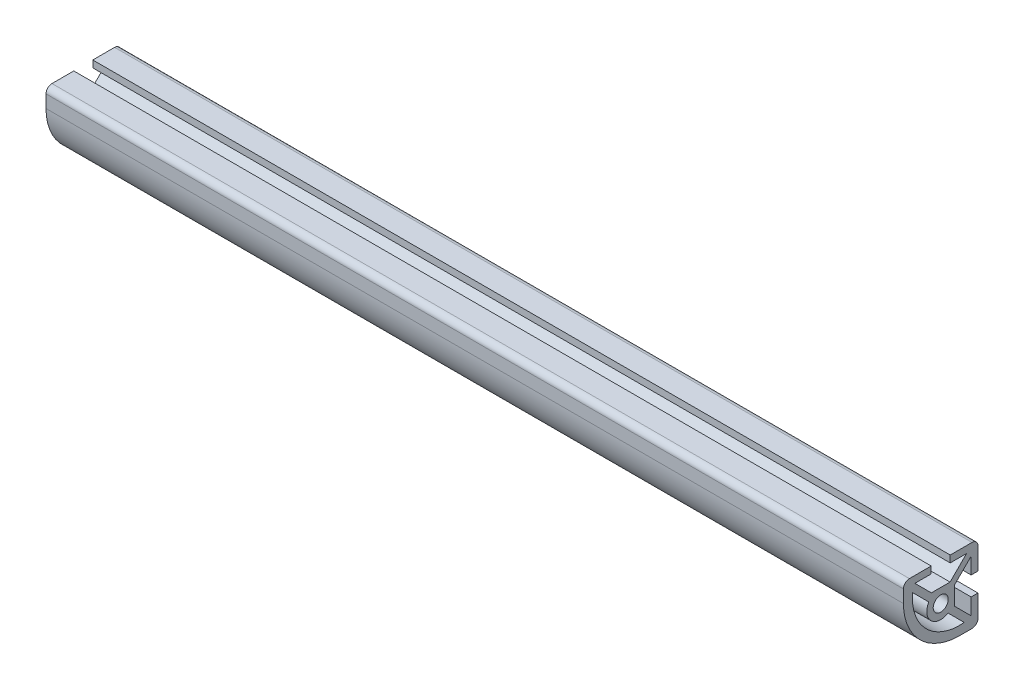
ISO-10303-21;
HEADER;
FILE_DESCRIPTION(('STEP AP214'),'2;1');
FILE_NAME('part.step','',(''),(''),'','','');
FILE_SCHEMA(('AUTOMOTIVE_DESIGN { 1 0 10303 214 1 1 1 1 }'));
ENDSEC;
DATA;
#1=APPLICATION_CONTEXT('core data for automotive mechanical design processes');
#2=APPLICATION_PROTOCOL_DEFINITION('international standard','automotive_design',2000,#1);
#3=PRODUCT_CONTEXT('',#1,'mechanical');
#4=PRODUCT('Part','Part','',(#3));
#5=PRODUCT_RELATED_PRODUCT_CATEGORY('part','',(#4));
#6=PRODUCT_DEFINITION_FORMATION('','',#4);
#7=PRODUCT_DEFINITION_CONTEXT('part definition',#1,'design');
#8=PRODUCT_DEFINITION('design','',#6,#7);
#9=PRODUCT_DEFINITION_SHAPE('','',#8);
#10=(LENGTH_UNIT() NAMED_UNIT(*) SI_UNIT(.MILLI.,.METRE.));
#11=(NAMED_UNIT(*) PLANE_ANGLE_UNIT() SI_UNIT($,.RADIAN.));
#12=(NAMED_UNIT(*) SI_UNIT($,.STERADIAN.) SOLID_ANGLE_UNIT());
#13=UNCERTAINTY_MEASURE_WITH_UNIT(LENGTH_MEASURE(1.E-05),#10,'distance_accuracy_value','');
#14=(GEOMETRIC_REPRESENTATION_CONTEXT(3) GLOBAL_UNCERTAINTY_ASSIGNED_CONTEXT((#13)) GLOBAL_UNIT_ASSIGNED_CONTEXT((#10,
#11,#12)) REPRESENTATION_CONTEXT('',''));
#15=CARTESIAN_POINT('',(0.,0.,0.));
#16=DIRECTION('',(0.,0.,1.));
#17=DIRECTION('',(1.,0.,0.));
#18=AXIS2_PLACEMENT_3D('',#15,#16,#17);
#19=CARTESIAN_POINT('',(146.05,10.668,10.6679999999999));
#20=DIRECTION('',(-1.,0.,0.));
#21=DIRECTION('',(0.,0.,1.));
#22=AXIS2_PLACEMENT_3D('',#19,#20,#21);
#23=PLANE('',#22);
#24=CARTESIAN_POINT('',(146.05,10.668,10.6679999999999));
#25=DIRECTION('',(1.,0.,0.));
#26=DIRECTION('',(0.,0.,1.));
#27=AXIS2_PLACEMENT_3D('',#24,#25,#26);
#28=CIRCLE('',#27,2.03200000000002);
#29=CARTESIAN_POINT('',(146.05,12.7,10.6679999999999));
#30=VERTEX_POINT('',#29);
#31=CARTESIAN_POINT('',(146.05,10.668,12.6999999999999));
#32=VERTEX_POINT('',#31);
#33=EDGE_CURVE('E229',#30,#32,#28,.T.);
#34=ORIENTED_EDGE('',*,*,#33,.T.);
#35=DIRECTION('',(0.,-1.,0.));
#36=VECTOR('',#35,1.);
#37=CARTESIAN_POINT('',(146.05,10.668,12.6999999999999));
#38=LINE('',#37,#36);
#39=CARTESIAN_POINT('',(146.05,6.35000000000034,12.6999999999999));
#40=VERTEX_POINT('',#39);
#41=EDGE_CURVE('E338',#32,#40,#38,.T.);
#42=ORIENTED_EDGE('',*,*,#41,.T.);
#43=CARTESIAN_POINT('',(146.05,6.35,-6.35000000000011));
#44=DIRECTION('',(1.,0.,0.));
#45=DIRECTION('',(0.,0.,-1.));
#46=AXIS2_PLACEMENT_3D('',#43,#44,#45);
#47=CIRCLE('',#46,19.05);
#48=CARTESIAN_POINT('',(146.05,-12.7,-6.35000000000012));
#49=VERTEX_POINT('',#48);
#50=EDGE_CURVE('E340',#40,#49,#47,.T.);
#51=ORIENTED_EDGE('',*,*,#50,.T.);
#52=DIRECTION('',(0.,0.,-1.));
#53=VECTOR('',#52,1.);
#54=CARTESIAN_POINT('',(146.05,-12.7,-10.6679999999999));
#55=LINE('',#54,#53);
#56=CARTESIAN_POINT('',(146.05,-12.7,-10.6679999999999));
#57=VERTEX_POINT('',#56);
#58=EDGE_CURVE('E342',#49,#57,#55,.T.);
#59=ORIENTED_EDGE('',*,*,#58,.T.);
#60=CARTESIAN_POINT('',(146.05,-10.668,-10.6679999999999));
#61=DIRECTION('',(1.,0.,0.));
#62=DIRECTION('',(0.,0.,1.));
#63=AXIS2_PLACEMENT_3D('',#60,#61,#62);
#64=CIRCLE('',#63,2.03200000000001);
#65=CARTESIAN_POINT('',(146.05,-10.668,-12.6999999999999));
#66=VERTEX_POINT('',#65);
#67=EDGE_CURVE('E344',#57,#66,#64,.T.);
#68=ORIENTED_EDGE('',*,*,#67,.T.);
#69=DIRECTION('',(0.,1.,0.));
#70=VECTOR('',#69,1.);
#71=CARTESIAN_POINT('',(146.05,-3.23850000000069,-12.6999999999999));
#72=LINE('',#71,#70);
#73=CARTESIAN_POINT('',(146.05,-3.23850000000069,-12.6999999999999));
#74=VERTEX_POINT('',#73);
#75=EDGE_CURVE('E346',#66,#74,#72,.T.);
#76=ORIENTED_EDGE('',*,*,#75,.T.);
#77=DIRECTION('',(0.,0.,1.));
#78=VECTOR('',#77,1.);
#79=CARTESIAN_POINT('',(146.05,-3.23850000000054,-10.3632000000016));
#80=LINE('',#79,#78);
#81=CARTESIAN_POINT('',(146.05,-3.23850000000054,-10.3632000000016));
#82=VERTEX_POINT('',#81);
#83=EDGE_CURVE('E348',#74,#82,#80,.T.);
#84=ORIENTED_EDGE('',*,*,#83,.T.);
#85=DIRECTION('',(0.,-1.,0.));
#86=VECTOR('',#85,1.);
#87=CARTESIAN_POINT('',(146.05,-8.80063543493584,-10.3632000000016));
#88=LINE('',#87,#86);
#89=CARTESIAN_POINT('',(146.05,-8.80063543493584,-10.3632000000016));
#90=VERTEX_POINT('',#89);
#91=EDGE_CURVE('E350',#82,#90,#88,.T.);
#92=ORIENTED_EDGE('',*,*,#91,.T.);
#93=DIRECTION('',(0.,0.707106781186543,0.707106781186552));
#94=VECTOR('',#93,1.);
#95=CARTESIAN_POINT('',(146.05,-3.18723566949115,-4.74980023455686));
#96=LINE('',#95,#94);
#97=CARTESIAN_POINT('',(146.05,-3.18723566949115,-4.74980023455686));
#98=VERTEX_POINT('',#97);
#99=EDGE_CURVE('E352',#90,#98,#96,.T.);
#100=ORIENTED_EDGE('',*,*,#99,.T.);
#101=DIRECTION('',(0.,1.,0.));
#102=VECTOR('',#101,1.);
#103=CARTESIAN_POINT('',(146.05,3.18723566949115,-4.74980023455665));
#104=LINE('',#103,#102);
#105=CARTESIAN_POINT('',(146.05,3.18723566949115,-4.74980023455665));
#106=VERTEX_POINT('',#105);
#107=EDGE_CURVE('E354',#98,#106,#104,.T.);
#108=ORIENTED_EDGE('',*,*,#107,.T.);
#109=DIRECTION('',(0.,0.707106781186543,-0.707106781186552));
#110=VECTOR('',#109,1.);
#111=CARTESIAN_POINT('',(146.05,8.80063543493585,-10.3632000000014));
#112=LINE('',#111,#110);
#113=CARTESIAN_POINT('',(146.05,8.80063543493585,-10.3632000000014));
#114=VERTEX_POINT('',#113);
#115=EDGE_CURVE('E356',#106,#114,#112,.T.);
#116=ORIENTED_EDGE('',*,*,#115,.T.);
#117=DIRECTION('',(0.,-1.,0.));
#118=VECTOR('',#117,1.);
#119=CARTESIAN_POINT('',(146.05,3.23850000000055,-10.3632000000014));
#120=LINE('',#119,#118);
#121=CARTESIAN_POINT('',(146.05,3.23850000000055,-10.3632000000014));
#122=VERTEX_POINT('',#121);
#123=EDGE_CURVE('E358',#114,#122,#120,.T.);
#124=ORIENTED_EDGE('',*,*,#123,.T.);
#125=DIRECTION('',(0.,0.,-1.));
#126=VECTOR('',#125,1.);
#127=CARTESIAN_POINT('',(146.05,3.23850000000069,-12.7));
#128=LINE('',#127,#126);
#129=CARTESIAN_POINT('',(146.05,3.23850000000069,-12.7));
#130=VERTEX_POINT('',#129);
#131=EDGE_CURVE('E360',#122,#130,#128,.T.);
#132=ORIENTED_EDGE('',*,*,#131,.T.);
#133=DIRECTION('',(0.,1.,0.));
#134=VECTOR('',#133,1.);
#135=CARTESIAN_POINT('',(146.05,10.668,-12.7));
#136=LINE('',#135,#134);
#137=CARTESIAN_POINT('',(146.05,10.668,-12.7));
#138=VERTEX_POINT('',#137);
#139=EDGE_CURVE('E362',#130,#138,#136,.T.);
#140=ORIENTED_EDGE('',*,*,#139,.T.);
#141=CARTESIAN_POINT('',(146.05,10.668,-10.668));
#142=DIRECTION('',(1.,0.,0.));
#143=DIRECTION('',(0.,0.,1.));
#144=AXIS2_PLACEMENT_3D('',#141,#142,#143);
#145=CIRCLE('',#144,2.03200000000001);
#146=CARTESIAN_POINT('',(146.05,12.7,-10.668));
#147=VERTEX_POINT('',#146);
#148=EDGE_CURVE('E364',#138,#147,#145,.T.);
#149=ORIENTED_EDGE('',*,*,#148,.T.);
#150=DIRECTION('',(0.,0.,1.));
#151=VECTOR('',#150,1.);
#152=CARTESIAN_POINT('',(146.05,12.7,-3.23850000000062));
#153=LINE('',#152,#151);
#154=CARTESIAN_POINT('',(146.05,12.7,-3.23850000000062));
#155=VERTEX_POINT('',#154);
#156=EDGE_CURVE('E366',#147,#155,#153,.T.);
#157=ORIENTED_EDGE('',*,*,#156,.T.);
#158=DIRECTION('',(0.,-1.,0.));
#159=VECTOR('',#158,1.);
#160=CARTESIAN_POINT('',(146.05,10.3632000000014,-3.23850000000062));
#161=LINE('',#160,#159);
#162=CARTESIAN_POINT('',(146.05,10.3632000000014,-3.23850000000062));
#163=VERTEX_POINT('',#162);
#164=EDGE_CURVE('E368',#155,#163,#161,.T.);
#165=ORIENTED_EDGE('',*,*,#164,.T.);
#166=DIRECTION('',(0.,0.,-1.));
#167=VECTOR('',#166,1.);
#168=CARTESIAN_POINT('',(146.05,10.3632000000014,-8.80063543493592));
#169=LINE('',#168,#167);
#170=CARTESIAN_POINT('',(146.05,10.3632000000014,-8.80063543493592));
#171=VERTEX_POINT('',#170);
#172=EDGE_CURVE('E370',#163,#171,#169,.T.);
#173=ORIENTED_EDGE('',*,*,#172,.T.);
#174=DIRECTION('',(0.,-0.707106781186537,0.707106781186558));
#175=VECTOR('',#174,1.);
#176=CARTESIAN_POINT('',(146.05,4.74980023455676,-3.18723566949106));
#177=LINE('',#176,#175);
#178=CARTESIAN_POINT('',(146.05,4.74980023455676,-3.18723566949106));
#179=VERTEX_POINT('',#178);
#180=EDGE_CURVE('E372',#171,#179,#177,.T.);
#181=ORIENTED_EDGE('',*,*,#180,.T.);
#182=DIRECTION('',(0.,0.,1.));
#183=VECTOR('',#182,1.);
#184=CARTESIAN_POINT('',(146.05,4.74980023455676,3.18723566949115));
#185=LINE('',#184,#183);
#186=CARTESIAN_POINT('',(146.05,4.74980023455676,3.18723566949115));
#187=VERTEX_POINT('',#186);
#188=EDGE_CURVE('E374',#179,#187,#185,.T.);
#189=ORIENTED_EDGE('',*,*,#188,.T.);
#190=DIRECTION('',(0.,0.707106781186543,0.707106781186552));
#191=VECTOR('',#190,1.);
#192=CARTESIAN_POINT('',(146.05,10.3632000000014,8.80063543493592));
#193=LINE('',#192,#191);
#194=CARTESIAN_POINT('',(146.05,10.3632000000014,8.80063543493592));
#195=VERTEX_POINT('',#194);
#196=EDGE_CURVE('E376',#187,#195,#193,.T.);
#197=ORIENTED_EDGE('',*,*,#196,.T.);
#198=DIRECTION('',(0.,0.,-1.));
#199=VECTOR('',#198,1.);
#200=CARTESIAN_POINT('',(146.05,10.3632000000014,3.23850000000062));
#201=LINE('',#200,#199);
#202=CARTESIAN_POINT('',(146.05,10.3632000000014,3.23850000000062));
#203=VERTEX_POINT('',#202);
#204=EDGE_CURVE('E378',#195,#203,#201,.T.);
#205=ORIENTED_EDGE('',*,*,#204,.T.);
#206=DIRECTION('',(0.,1.,0.));
#207=VECTOR('',#206,1.);
#208=CARTESIAN_POINT('',(146.05,12.7,3.23850000000062));
#209=LINE('',#208,#207);
#210=CARTESIAN_POINT('',(146.05,12.7,3.23850000000062));
#211=VERTEX_POINT('',#210);
#212=EDGE_CURVE('E380',#203,#211,#209,.T.);
#213=ORIENTED_EDGE('',*,*,#212,.T.);
#214=DIRECTION('',(0.,0.,1.));
#215=VECTOR('',#214,1.);
#216=CARTESIAN_POINT('',(146.05,12.7,10.6679999999999));
#217=LINE('',#216,#215);
#218=EDGE_CURVE('E56',#211,#30,#217,.T.);
#219=ORIENTED_EDGE('',*,*,#218,.T.);
#220=EDGE_LOOP('',(#34,#42,#51,#59,#68,#76,#84,#92,#100,#108,#116,#124,#132,#140,#149,#157,#165,
#173,#181,#189,#197,#205,#213,#219));
#221=FACE_BOUND('',#220,.T.);
#222=CARTESIAN_POINT('',(146.05,0.,0.));
#223=DIRECTION('',(-1.,0.,0.));
#224=DIRECTION('',(0.,0.,-1.));
#225=AXIS2_PLACEMENT_3D('',#222,#223,#224);
#226=CIRCLE('',#225,4.74980023455676);
#227=CARTESIAN_POINT('',(146.05,-4.04776343648096,-2.48519887141517));
#228=VERTEX_POINT('',#227);
#229=CARTESIAN_POINT('',(146.05,2.48519887141525,4.04776343648091));
#230=VERTEX_POINT('',#229);
#231=EDGE_CURVE('E226',#228,#230,#226,.T.);
#232=ORIENTED_EDGE('',*,*,#231,.F.);
#233=DIRECTION('',(0.,0.707106781186554,0.707106781186541));
#234=VECTOR('',#233,1.);
#235=CARTESIAN_POINT('',(146.05,-4.04776343648096,-2.48519887141517));
#236=LINE('',#235,#234);
#237=CARTESIAN_POINT('',(146.05,-9.56631586282329,-8.00375129775741));
#238=VERTEX_POINT('',#237);
#239=EDGE_CURVE('E331',#238,#228,#236,.T.);
#240=ORIENTED_EDGE('',*,*,#239,.F.);
#241=CARTESIAN_POINT('',(146.05,6.34999999999999,-6.35000000000011));
#242=DIRECTION('',(1.,0.,0.));
#243=DIRECTION('',(0.,0.,-1.));
#244=AXIS2_PLACEMENT_3D('',#241,#242,#243);
#245=CIRCLE('',#244,16.0019999999998);
#246=CARTESIAN_POINT('',(146.05,8.00375129775759,9.56631586282315));
#247=VERTEX_POINT('',#246);
#248=EDGE_CURVE('E329',#247,#238,#245,.T.);
#249=ORIENTED_EDGE('',*,*,#248,.F.);
#250=DIRECTION('',(0.,0.707106781186554,0.707106781186541));
#251=VECTOR('',#250,1.);
#252=CARTESIAN_POINT('',(146.05,8.00375129775759,9.56631586282315));
#253=LINE('',#252,#251);
#254=EDGE_CURVE('E327',#230,#247,#253,.T.);
#255=ORIENTED_EDGE('',*,*,#254,.F.);
#256=EDGE_LOOP('',(#232,#240,#249,#255));
#257=FACE_BOUND('',#256,.T.);
#258=CARTESIAN_POINT('',(146.05,0.,0.));
#259=DIRECTION('',(1.,0.,0.));
#260=DIRECTION('',(0.,0.,-1.));
#261=AXIS2_PLACEMENT_3D('',#258,#259,#260);
#262=CIRCLE('',#261,2.55269999999991);
#263=CARTESIAN_POINT('',(146.05,0.,-2.55269999999991));
#264=VERTEX_POINT('',#263);
#265=EDGE_CURVE('E323',#264,#264,#262,.T.);
#266=ORIENTED_EDGE('',*,*,#265,.F.);
#267=EDGE_LOOP('',(#266));
#268=FACE_BOUND('',#267,.T.);
#269=ADVANCED_FACE('F33',(#221,#257,#268),#23,.F.);
#270=CARTESIAN_POINT('',(146.05,10.668,10.6679999999999));
#271=DIRECTION('',(-1.,0.,0.));
#272=DIRECTION('',(0.,0.,1.));
#273=AXIS2_PLACEMENT_3D('',#270,#271,#272);
#274=CYLINDRICAL_SURFACE('',#273,2.03200000000002);
#275=DIRECTION('',(-1.,0.,0.));
#276=VECTOR('',#275,1.);
#277=CARTESIAN_POINT('',(146.05,12.7,10.6679999999999));
#278=LINE('',#277,#276);
#279=CARTESIAN_POINT('',(-146.05,12.7,10.6679999999999));
#280=VERTEX_POINT('',#279);
#281=EDGE_CURVE('E383',#30,#280,#278,.T.);
#282=ORIENTED_EDGE('',*,*,#281,.T.);
#283=CARTESIAN_POINT('',(-146.05,10.668,10.6679999999999));
#284=DIRECTION('',(1.,0.,0.));
#285=DIRECTION('',(0.,0.,1.));
#286=AXIS2_PLACEMENT_3D('',#283,#284,#285);
#287=CIRCLE('',#286,2.03200000000002);
#288=CARTESIAN_POINT('',(-146.05,10.668,12.6999999999999));
#289=VERTEX_POINT('',#288);
#290=EDGE_CURVE('E251',#280,#289,#287,.T.);
#291=ORIENTED_EDGE('',*,*,#290,.T.);
#292=DIRECTION('',(-1.,0.,0.));
#293=VECTOR('',#292,1.);
#294=CARTESIAN_POINT('',(146.05,10.668,12.6999999999999));
#295=LINE('',#294,#293);
#296=EDGE_CURVE('E11',#32,#289,#295,.T.);
#297=ORIENTED_EDGE('',*,*,#296,.F.);
#298=ORIENTED_EDGE('',*,*,#33,.F.);
#299=EDGE_LOOP('',(#282,#291,#297,#298));
#300=FACE_BOUND('',#299,.T.);
#301=ADVANCED_FACE('F35',(#300),#274,.T.);
#302=CARTESIAN_POINT('',(146.05,10.668,12.6999999999999));
#303=DIRECTION('',(0.,0.,-1.));
#304=DIRECTION('',(-1.,0.,0.));
#305=AXIS2_PLACEMENT_3D('',#302,#303,#304);
#306=PLANE('',#305);
#307=ORIENTED_EDGE('',*,*,#296,.T.);
#308=DIRECTION('',(0.,-1.,0.));
#309=VECTOR('',#308,1.);
#310=CARTESIAN_POINT('',(-146.05,10.668,12.6999999999999));
#311=LINE('',#310,#309);
#312=CARTESIAN_POINT('',(-146.05,6.35000000000034,12.6999999999999));
#313=VERTEX_POINT('',#312);
#314=EDGE_CURVE('E254',#289,#313,#311,.T.);
#315=ORIENTED_EDGE('',*,*,#314,.T.);
#316=DIRECTION('',(-1.,0.,0.));
#317=VECTOR('',#316,1.);
#318=CARTESIAN_POINT('',(146.05,6.35000000000034,12.6999999999999));
#319=LINE('',#318,#317);
#320=EDGE_CURVE('E41',#40,#313,#319,.T.);
#321=ORIENTED_EDGE('',*,*,#320,.F.);
#322=ORIENTED_EDGE('',*,*,#41,.F.);
#323=EDGE_LOOP('',(#307,#315,#321,#322));
#324=FACE_BOUND('',#323,.T.);
#325=ADVANCED_FACE('F437',(#324),#306,.F.);
#326=CARTESIAN_POINT('',(146.05,6.35,-6.35000000000011));
#327=DIRECTION('',(-1.,0.,0.));
#328=DIRECTION('',(0.,0.,1.));
#329=AXIS2_PLACEMENT_3D('',#326,#327,#328);
#330=CYLINDRICAL_SURFACE('',#329,19.05);
#331=ORIENTED_EDGE('',*,*,#320,.T.);
#332=CARTESIAN_POINT('',(-146.05,6.35,-6.35000000000011));
#333=DIRECTION('',(1.,0.,0.));
#334=DIRECTION('',(0.,0.,-1.));
#335=AXIS2_PLACEMENT_3D('',#332,#333,#334);
#336=CIRCLE('',#335,19.05);
#337=CARTESIAN_POINT('',(-146.05,-12.7,-6.35000000000012));
#338=VERTEX_POINT('',#337);
#339=EDGE_CURVE('E257',#313,#338,#336,.T.);
#340=ORIENTED_EDGE('',*,*,#339,.T.);
#341=DIRECTION('',(-1.,0.,0.));
#342=VECTOR('',#341,1.);
#343=CARTESIAN_POINT('',(146.05,-12.7,-6.35000000000012));
#344=LINE('',#343,#342);
#345=EDGE_CURVE('E425',#49,#338,#344,.T.);
#346=ORIENTED_EDGE('',*,*,#345,.F.);
#347=ORIENTED_EDGE('',*,*,#50,.F.);
#348=EDGE_LOOP('',(#331,#340,#346,#347));
#349=FACE_BOUND('',#348,.T.);
#350=ADVANCED_FACE('F430',(#349),#330,.T.);
#351=CARTESIAN_POINT('',(146.05,-12.7,-10.6679999999999));
#352=DIRECTION('',(0.,1.,0.));
#353=DIRECTION('',(0.,0.,1.));
#354=AXIS2_PLACEMENT_3D('',#351,#352,#353);
#355=PLANE('',#354);
#356=ORIENTED_EDGE('',*,*,#345,.T.);
#357=DIRECTION('',(0.,0.,-1.));
#358=VECTOR('',#357,1.);
#359=CARTESIAN_POINT('',(-146.05,-12.7,-10.6679999999999));
#360=LINE('',#359,#358);
#361=CARTESIAN_POINT('',(-146.05,-12.7,-10.6679999999999));
#362=VERTEX_POINT('',#361);
#363=EDGE_CURVE('E260',#338,#362,#360,.T.);
#364=ORIENTED_EDGE('',*,*,#363,.T.);
#365=DIRECTION('',(-1.,0.,0.));
#366=VECTOR('',#365,1.);
#367=CARTESIAN_POINT('',(146.05,-12.7,-10.6679999999999));
#368=LINE('',#367,#366);
#369=EDGE_CURVE('E423',#57,#362,#368,.T.);
#370=ORIENTED_EDGE('',*,*,#369,.F.);
#371=ORIENTED_EDGE('',*,*,#58,.F.);
#372=EDGE_LOOP('',(#356,#364,#370,#371));
#373=FACE_BOUND('',#372,.T.);
#374=ADVANCED_FACE('F540',(#373),#355,.F.);
#375=CARTESIAN_POINT('',(146.05,-10.668,-10.6679999999999));
#376=DIRECTION('',(-1.,0.,0.));
#377=DIRECTION('',(0.,0.,1.));
#378=AXIS2_PLACEMENT_3D('',#375,#376,#377);
#379=CYLINDRICAL_SURFACE('',#378,2.03200000000001);
#380=ORIENTED_EDGE('',*,*,#369,.T.);
#381=CARTESIAN_POINT('',(-146.05,-10.668,-10.6679999999999));
#382=DIRECTION('',(1.,0.,0.));
#383=DIRECTION('',(0.,0.,1.));
#384=AXIS2_PLACEMENT_3D('',#381,#382,#383);
#385=CIRCLE('',#384,2.03200000000001);
#386=CARTESIAN_POINT('',(-146.05,-10.668,-12.6999999999999));
#387=VERTEX_POINT('',#386);
#388=EDGE_CURVE('E263',#362,#387,#385,.T.);
#389=ORIENTED_EDGE('',*,*,#388,.T.);
#390=DIRECTION('',(-1.,0.,0.));
#391=VECTOR('',#390,1.);
#392=CARTESIAN_POINT('',(146.05,-10.668,-12.6999999999999));
#393=LINE('',#392,#391);
#394=EDGE_CURVE('E421',#66,#387,#393,.T.);
#395=ORIENTED_EDGE('',*,*,#394,.F.);
#396=ORIENTED_EDGE('',*,*,#67,.F.);
#397=EDGE_LOOP('',(#380,#389,#395,#396));
#398=FACE_BOUND('',#397,.T.);
#399=ADVANCED_FACE('F537',(#398),#379,.T.);
#400=CARTESIAN_POINT('',(146.05,-3.23850000000069,-12.6999999999999));
#401=DIRECTION('',(0.,0.,1.));
#402=DIRECTION('',(1.,0.,0.));
#403=AXIS2_PLACEMENT_3D('',#400,#401,#402);
#404=PLANE('',#403);
#405=ORIENTED_EDGE('',*,*,#394,.T.);
#406=DIRECTION('',(0.,1.,0.));
#407=VECTOR('',#406,1.);
#408=CARTESIAN_POINT('',(-146.05,-3.23850000000069,-12.6999999999999));
#409=LINE('',#408,#407);
#410=CARTESIAN_POINT('',(-146.05,-3.23850000000069,-12.6999999999999));
#411=VERTEX_POINT('',#410);
#412=EDGE_CURVE('E266',#387,#411,#409,.T.);
#413=ORIENTED_EDGE('',*,*,#412,.T.);
#414=DIRECTION('',(-1.,0.,0.));
#415=VECTOR('',#414,1.);
#416=CARTESIAN_POINT('',(146.05,-3.23850000000069,-12.6999999999999));
#417=LINE('',#416,#415);
#418=EDGE_CURVE('E419',#74,#411,#417,.T.);
#419=ORIENTED_EDGE('',*,*,#418,.F.);
#420=ORIENTED_EDGE('',*,*,#75,.F.);
#421=EDGE_LOOP('',(#405,#413,#419,#420));
#422=FACE_BOUND('',#421,.T.);
#423=ADVANCED_FACE('F532',(#422),#404,.F.);
#424=CARTESIAN_POINT('',(146.05,-3.23850000000054,-10.3632000000016));
#425=DIRECTION('',(0.,-1.,0.));
#426=DIRECTION('',(0.,0.,-1.));
#427=AXIS2_PLACEMENT_3D('',#424,#425,#426);
#428=PLANE('',#427);
#429=ORIENTED_EDGE('',*,*,#418,.T.);
#430=DIRECTION('',(0.,0.,1.));
#431=VECTOR('',#430,1.);
#432=CARTESIAN_POINT('',(-146.05,-3.23850000000054,-10.3632000000016));
#433=LINE('',#432,#431);
#434=CARTESIAN_POINT('',(-146.05,-3.23850000000054,-10.3632000000016));
#435=VERTEX_POINT('',#434);
#436=EDGE_CURVE('E269',#411,#435,#433,.T.);
#437=ORIENTED_EDGE('',*,*,#436,.T.);
#438=DIRECTION('',(-1.,0.,0.));
#439=VECTOR('',#438,1.);
#440=CARTESIAN_POINT('',(146.05,-3.23850000000054,-10.3632000000016));
#441=LINE('',#440,#439);
#442=EDGE_CURVE('E417',#82,#435,#441,.T.);
#443=ORIENTED_EDGE('',*,*,#442,.F.);
#444=ORIENTED_EDGE('',*,*,#83,.F.);
#445=EDGE_LOOP('',(#429,#437,#443,#444));
#446=FACE_BOUND('',#445,.T.);
#447=ADVANCED_FACE('F528',(#446),#428,.F.);
#448=CARTESIAN_POINT('',(146.05,-8.80063543493584,-10.3632000000016));
#449=DIRECTION('',(0.,0.,-1.));
#450=DIRECTION('',(-1.,0.,0.));
#451=AXIS2_PLACEMENT_3D('',#448,#449,#450);
#452=PLANE('',#451);
#453=ORIENTED_EDGE('',*,*,#442,.T.);
#454=DIRECTION('',(0.,-1.,0.));
#455=VECTOR('',#454,1.);
#456=CARTESIAN_POINT('',(-146.05,-8.80063543493584,-10.3632000000016));
#457=LINE('',#456,#455);
#458=CARTESIAN_POINT('',(-146.05,-8.80063543493584,-10.3632000000016));
#459=VERTEX_POINT('',#458);
#460=EDGE_CURVE('E272',#435,#459,#457,.T.);
#461=ORIENTED_EDGE('',*,*,#460,.T.);
#462=DIRECTION('',(-1.,0.,0.));
#463=VECTOR('',#462,1.);
#464=CARTESIAN_POINT('',(146.05,-8.80063543493584,-10.3632000000016));
#465=LINE('',#464,#463);
#466=EDGE_CURVE('E415',#90,#459,#465,.T.);
#467=ORIENTED_EDGE('',*,*,#466,.F.);
#468=ORIENTED_EDGE('',*,*,#91,.F.);
#469=EDGE_LOOP('',(#453,#461,#467,#468));
#470=FACE_BOUND('',#469,.T.);
#471=ADVANCED_FACE('F523',(#470),#452,.F.);
#472=CARTESIAN_POINT('',(146.05,-3.18723566949115,-4.74980023455686));
#473=DIRECTION('',(0.,-0.707106781186552,0.707106781186543));
#474=DIRECTION('',(0.,-0.707106781186543,-0.707106781186552));
#475=AXIS2_PLACEMENT_3D('',#472,#473,#474);
#476=PLANE('',#475);
#477=ORIENTED_EDGE('',*,*,#466,.T.);
#478=DIRECTION('',(0.,0.707106781186543,0.707106781186552));
#479=VECTOR('',#478,1.);
#480=CARTESIAN_POINT('',(-146.05,-3.18723566949115,-4.74980023455686));
#481=LINE('',#480,#479);
#482=CARTESIAN_POINT('',(-146.05,-3.18723566949115,-4.74980023455686));
#483=VERTEX_POINT('',#482);
#484=EDGE_CURVE('E275',#459,#483,#481,.T.);
#485=ORIENTED_EDGE('',*,*,#484,.T.);
#486=DIRECTION('',(-1.,0.,0.));
#487=VECTOR('',#486,1.);
#488=CARTESIAN_POINT('',(146.05,-3.18723566949115,-4.74980023455686));
#489=LINE('',#488,#487);
#490=EDGE_CURVE('E413',#98,#483,#489,.T.);
#491=ORIENTED_EDGE('',*,*,#490,.F.);
#492=ORIENTED_EDGE('',*,*,#99,.F.);
#493=EDGE_LOOP('',(#477,#485,#491,#492));
#494=FACE_BOUND('',#493,.T.);
#495=ADVANCED_FACE('F518',(#494),#476,.F.);
#496=CARTESIAN_POINT('',(146.05,3.18723566949115,-4.74980023455665));
#497=DIRECTION('',(0.,0.,1.));
#498=DIRECTION('',(0.,-1.,0.));
#499=AXIS2_PLACEMENT_3D('',#496,#497,#498);
#500=PLANE('',#499);
#501=ORIENTED_EDGE('',*,*,#490,.T.);
#502=DIRECTION('',(0.,1.,0.));
#503=VECTOR('',#502,1.);
#504=CARTESIAN_POINT('',(-146.05,3.18723566949115,-4.74980023455665));
#505=LINE('',#504,#503);
#506=CARTESIAN_POINT('',(-146.05,3.18723566949115,-4.74980023455665));
#507=VERTEX_POINT('',#506);
#508=EDGE_CURVE('E278',#483,#507,#505,.T.);
#509=ORIENTED_EDGE('',*,*,#508,.T.);
#510=DIRECTION('',(-1.,0.,0.));
#511=VECTOR('',#510,1.);
#512=CARTESIAN_POINT('',(146.05,3.18723566949115,-4.74980023455665));
#513=LINE('',#512,#511);
#514=EDGE_CURVE('E411',#106,#507,#513,.T.);
#515=ORIENTED_EDGE('',*,*,#514,.F.);
#516=ORIENTED_EDGE('',*,*,#107,.F.);
#517=EDGE_LOOP('',(#501,#509,#515,#516));
#518=FACE_BOUND('',#517,.T.);
#519=ADVANCED_FACE('F513',(#518),#500,.F.);
#520=CARTESIAN_POINT('',(146.05,8.80063543493585,-10.3632000000014));
#521=DIRECTION('',(0.,0.707106781186552,0.707106781186543));
#522=DIRECTION('',(0.,-0.707106781186543,0.707106781186552));
#523=AXIS2_PLACEMENT_3D('',#520,#521,#522);
#524=PLANE('',#523);
#525=ORIENTED_EDGE('',*,*,#514,.T.);
#526=DIRECTION('',(0.,0.707106781186543,-0.707106781186552));
#527=VECTOR('',#526,1.);
#528=CARTESIAN_POINT('',(-146.05,8.80063543493585,-10.3632000000014));
#529=LINE('',#528,#527);
#530=CARTESIAN_POINT('',(-146.05,8.80063543493585,-10.3632000000014));
#531=VERTEX_POINT('',#530);
#532=EDGE_CURVE('E281',#507,#531,#529,.T.);
#533=ORIENTED_EDGE('',*,*,#532,.T.);
#534=DIRECTION('',(-1.,0.,0.));
#535=VECTOR('',#534,1.);
#536=CARTESIAN_POINT('',(146.05,8.80063543493585,-10.3632000000014));
#537=LINE('',#536,#535);
#538=EDGE_CURVE('E409',#114,#531,#537,.T.);
#539=ORIENTED_EDGE('',*,*,#538,.F.);
#540=ORIENTED_EDGE('',*,*,#115,.F.);
#541=EDGE_LOOP('',(#525,#533,#539,#540));
#542=FACE_BOUND('',#541,.T.);
#543=ADVANCED_FACE('F508',(#542),#524,.F.);
#544=CARTESIAN_POINT('',(146.05,3.23850000000055,-10.3632000000014));
#545=DIRECTION('',(0.,0.,-1.));
#546=DIRECTION('',(-1.,0.,0.));
#547=AXIS2_PLACEMENT_3D('',#544,#545,#546);
#548=PLANE('',#547);
#549=ORIENTED_EDGE('',*,*,#538,.T.);
#550=DIRECTION('',(0.,-1.,0.));
#551=VECTOR('',#550,1.);
#552=CARTESIAN_POINT('',(-146.05,3.23850000000055,-10.3632000000014));
#553=LINE('',#552,#551);
#554=CARTESIAN_POINT('',(-146.05,3.23850000000055,-10.3632000000014));
#555=VERTEX_POINT('',#554);
#556=EDGE_CURVE('E284',#531,#555,#553,.T.);
#557=ORIENTED_EDGE('',*,*,#556,.T.);
#558=DIRECTION('',(-1.,0.,0.));
#559=VECTOR('',#558,1.);
#560=CARTESIAN_POINT('',(146.05,3.23850000000055,-10.3632000000014));
#561=LINE('',#560,#559);
#562=EDGE_CURVE('E407',#122,#555,#561,.T.);
#563=ORIENTED_EDGE('',*,*,#562,.F.);
#564=ORIENTED_EDGE('',*,*,#123,.F.);
#565=EDGE_LOOP('',(#549,#557,#563,#564));
#566=FACE_BOUND('',#565,.T.);
#567=ADVANCED_FACE('F503',(#566),#548,.F.);
#568=CARTESIAN_POINT('',(146.05,3.23850000000069,-12.7));
#569=DIRECTION('',(0.,1.,0.));
#570=DIRECTION('',(0.,0.,1.));
#571=AXIS2_PLACEMENT_3D('',#568,#569,#570);
#572=PLANE('',#571);
#573=ORIENTED_EDGE('',*,*,#562,.T.);
#574=DIRECTION('',(0.,0.,-1.));
#575=VECTOR('',#574,1.);
#576=CARTESIAN_POINT('',(-146.05,3.23850000000069,-12.7));
#577=LINE('',#576,#575);
#578=CARTESIAN_POINT('',(-146.05,3.23850000000069,-12.7));
#579=VERTEX_POINT('',#578);
#580=EDGE_CURVE('E287',#555,#579,#577,.T.);
#581=ORIENTED_EDGE('',*,*,#580,.T.);
#582=DIRECTION('',(-1.,0.,0.));
#583=VECTOR('',#582,1.);
#584=CARTESIAN_POINT('',(146.05,3.23850000000069,-12.7));
#585=LINE('',#584,#583);
#586=EDGE_CURVE('E405',#130,#579,#585,.T.);
#587=ORIENTED_EDGE('',*,*,#586,.F.);
#588=ORIENTED_EDGE('',*,*,#131,.F.);
#589=EDGE_LOOP('',(#573,#581,#587,#588));
#590=FACE_BOUND('',#589,.T.);
#591=ADVANCED_FACE('F498',(#590),#572,.F.);
#592=CARTESIAN_POINT('',(146.05,10.668,-12.7));
#593=DIRECTION('',(0.,0.,1.));
#594=DIRECTION('',(1.,0.,0.));
#595=AXIS2_PLACEMENT_3D('',#592,#593,#594);
#596=PLANE('',#595);
#597=ORIENTED_EDGE('',*,*,#586,.T.);
#598=DIRECTION('',(0.,1.,0.));
#599=VECTOR('',#598,1.);
#600=CARTESIAN_POINT('',(-146.05,10.668,-12.7));
#601=LINE('',#600,#599);
#602=CARTESIAN_POINT('',(-146.05,10.668,-12.7));
#603=VERTEX_POINT('',#602);
#604=EDGE_CURVE('E290',#579,#603,#601,.T.);
#605=ORIENTED_EDGE('',*,*,#604,.T.);
#606=DIRECTION('',(-1.,0.,0.));
#607=VECTOR('',#606,1.);
#608=CARTESIAN_POINT('',(146.05,10.668,-12.7));
#609=LINE('',#608,#607);
#610=EDGE_CURVE('E403',#138,#603,#609,.T.);
#611=ORIENTED_EDGE('',*,*,#610,.F.);
#612=ORIENTED_EDGE('',*,*,#139,.F.);
#613=EDGE_LOOP('',(#597,#605,#611,#612));
#614=FACE_BOUND('',#613,.T.);
#615=ADVANCED_FACE('F493',(#614),#596,.F.);
#616=CARTESIAN_POINT('',(146.05,10.668,-10.668));
#617=DIRECTION('',(-1.,0.,0.));
#618=DIRECTION('',(0.,0.,1.));
#619=AXIS2_PLACEMENT_3D('',#616,#617,#618);
#620=CYLINDRICAL_SURFACE('',#619,2.03200000000001);
#621=ORIENTED_EDGE('',*,*,#610,.T.);
#622=CARTESIAN_POINT('',(-146.05,10.668,-10.668));
#623=DIRECTION('',(1.,0.,0.));
#624=DIRECTION('',(0.,0.,1.));
#625=AXIS2_PLACEMENT_3D('',#622,#623,#624);
#626=CIRCLE('',#625,2.03200000000001);
#627=CARTESIAN_POINT('',(-146.05,12.7,-10.668));
#628=VERTEX_POINT('',#627);
#629=EDGE_CURVE('E293',#603,#628,#626,.T.);
#630=ORIENTED_EDGE('',*,*,#629,.T.);
#631=DIRECTION('',(-1.,0.,0.));
#632=VECTOR('',#631,1.);
#633=CARTESIAN_POINT('',(146.05,12.7,-10.668));
#634=LINE('',#633,#632);
#635=EDGE_CURVE('E401',#147,#628,#634,.T.);
#636=ORIENTED_EDGE('',*,*,#635,.F.);
#637=ORIENTED_EDGE('',*,*,#148,.F.);
#638=EDGE_LOOP('',(#621,#630,#636,#637));
#639=FACE_BOUND('',#638,.T.);
#640=ADVANCED_FACE('F488',(#639),#620,.T.);
#641=CARTESIAN_POINT('',(146.05,12.7,-3.23850000000062));
#642=DIRECTION('',(0.,-1.,0.));
#643=DIRECTION('',(0.,0.,-1.));
#644=AXIS2_PLACEMENT_3D('',#641,#642,#643);
#645=PLANE('',#644);
#646=ORIENTED_EDGE('',*,*,#635,.T.);
#647=DIRECTION('',(0.,0.,1.));
#648=VECTOR('',#647,1.);
#649=CARTESIAN_POINT('',(-146.05,12.7,-3.23850000000062));
#650=LINE('',#649,#648);
#651=CARTESIAN_POINT('',(-146.05,12.7,-3.23850000000062));
#652=VERTEX_POINT('',#651);
#653=EDGE_CURVE('E296',#628,#652,#650,.T.);
#654=ORIENTED_EDGE('',*,*,#653,.T.);
#655=DIRECTION('',(-1.,0.,0.));
#656=VECTOR('',#655,1.);
#657=CARTESIAN_POINT('',(146.05,12.7,-3.23850000000062));
#658=LINE('',#657,#656);
#659=EDGE_CURVE('E399',#155,#652,#658,.T.);
#660=ORIENTED_EDGE('',*,*,#659,.F.);
#661=ORIENTED_EDGE('',*,*,#156,.F.);
#662=EDGE_LOOP('',(#646,#654,#660,#661));
#663=FACE_BOUND('',#662,.T.);
#664=ADVANCED_FACE('F483',(#663),#645,.F.);
#665=CARTESIAN_POINT('',(146.05,10.3632000000014,-3.23850000000062));
#666=DIRECTION('',(0.,0.,-1.));
#667=DIRECTION('',(-1.,0.,0.));
#668=AXIS2_PLACEMENT_3D('',#665,#666,#667);
#669=PLANE('',#668);
#670=ORIENTED_EDGE('',*,*,#659,.T.);
#671=DIRECTION('',(0.,-1.,0.));
#672=VECTOR('',#671,1.);
#673=CARTESIAN_POINT('',(-146.05,10.3632000000014,-3.23850000000062));
#674=LINE('',#673,#672);
#675=CARTESIAN_POINT('',(-146.05,10.3632000000014,-3.23850000000062));
#676=VERTEX_POINT('',#675);
#677=EDGE_CURVE('E299',#652,#676,#674,.T.);
#678=ORIENTED_EDGE('',*,*,#677,.T.);
#679=DIRECTION('',(-1.,0.,0.));
#680=VECTOR('',#679,1.);
#681=CARTESIAN_POINT('',(146.05,10.3632000000014,-3.23850000000062));
#682=LINE('',#681,#680);
#683=EDGE_CURVE('E397',#163,#676,#682,.T.);
#684=ORIENTED_EDGE('',*,*,#683,.F.);
#685=ORIENTED_EDGE('',*,*,#164,.F.);
#686=EDGE_LOOP('',(#670,#678,#684,#685));
#687=FACE_BOUND('',#686,.T.);
#688=ADVANCED_FACE('F478',(#687),#669,.F.);
#689=CARTESIAN_POINT('',(146.05,10.3632000000014,-8.80063543493592));
#690=DIRECTION('',(0.,1.,0.));
#691=DIRECTION('',(0.,0.,1.));
#692=AXIS2_PLACEMENT_3D('',#689,#690,#691);
#693=PLANE('',#692);
#694=ORIENTED_EDGE('',*,*,#683,.T.);
#695=DIRECTION('',(0.,0.,-1.));
#696=VECTOR('',#695,1.);
#697=CARTESIAN_POINT('',(-146.05,10.3632000000014,-8.80063543493592));
#698=LINE('',#697,#696);
#699=CARTESIAN_POINT('',(-146.05,10.3632000000014,-8.80063543493592));
#700=VERTEX_POINT('',#699);
#701=EDGE_CURVE('E302',#676,#700,#698,.T.);
#702=ORIENTED_EDGE('',*,*,#701,.T.);
#703=DIRECTION('',(-1.,0.,0.));
#704=VECTOR('',#703,1.);
#705=CARTESIAN_POINT('',(146.05,10.3632000000014,-8.80063543493592));
#706=LINE('',#705,#704);
#707=EDGE_CURVE('E395',#171,#700,#706,.T.);
#708=ORIENTED_EDGE('',*,*,#707,.F.);
#709=ORIENTED_EDGE('',*,*,#172,.F.);
#710=EDGE_LOOP('',(#694,#702,#708,#709));
#711=FACE_BOUND('',#710,.T.);
#712=ADVANCED_FACE('F473',(#711),#693,.F.);
#713=CARTESIAN_POINT('',(146.05,4.74980023455676,-3.18723566949106));
#714=DIRECTION('',(0.,-0.707106781186558,-0.707106781186537));
#715=DIRECTION('',(0.,0.707106781186537,-0.707106781186558));
#716=AXIS2_PLACEMENT_3D('',#713,#714,#715);
#717=PLANE('',#716);
#718=ORIENTED_EDGE('',*,*,#707,.T.);
#719=DIRECTION('',(0.,-0.707106781186537,0.707106781186558));
#720=VECTOR('',#719,1.);
#721=CARTESIAN_POINT('',(-146.05,4.74980023455676,-3.18723566949106));
#722=LINE('',#721,#720);
#723=CARTESIAN_POINT('',(-146.05,4.74980023455676,-3.18723566949106));
#724=VERTEX_POINT('',#723);
#725=EDGE_CURVE('E305',#700,#724,#722,.T.);
#726=ORIENTED_EDGE('',*,*,#725,.T.);
#727=DIRECTION('',(-1.,0.,0.));
#728=VECTOR('',#727,1.);
#729=CARTESIAN_POINT('',(146.05,4.74980023455676,-3.18723566949106));
#730=LINE('',#729,#728);
#731=EDGE_CURVE('E393',#179,#724,#730,.T.);
#732=ORIENTED_EDGE('',*,*,#731,.F.);
#733=ORIENTED_EDGE('',*,*,#180,.F.);
#734=EDGE_LOOP('',(#718,#726,#732,#733));
#735=FACE_BOUND('',#734,.T.);
#736=ADVANCED_FACE('F468',(#735),#717,.F.);
#737=CARTESIAN_POINT('',(146.05,4.74980023455676,3.18723566949115));
#738=DIRECTION('',(0.,-1.,0.));
#739=DIRECTION('',(0.,0.,-1.));
#740=AXIS2_PLACEMENT_3D('',#737,#738,#739);
#741=PLANE('',#740);
#742=ORIENTED_EDGE('',*,*,#731,.T.);
#743=DIRECTION('',(0.,0.,1.));
#744=VECTOR('',#743,1.);
#745=CARTESIAN_POINT('',(-146.05,4.74980023455676,3.18723566949115));
#746=LINE('',#745,#744);
#747=CARTESIAN_POINT('',(-146.05,4.74980023455676,3.18723566949115));
#748=VERTEX_POINT('',#747);
#749=EDGE_CURVE('E308',#724,#748,#746,.T.);
#750=ORIENTED_EDGE('',*,*,#749,.T.);
#751=DIRECTION('',(-1.,0.,0.));
#752=VECTOR('',#751,1.);
#753=CARTESIAN_POINT('',(146.05,4.74980023455676,3.18723566949115));
#754=LINE('',#753,#752);
#755=EDGE_CURVE('E391',#187,#748,#754,.T.);
#756=ORIENTED_EDGE('',*,*,#755,.F.);
#757=ORIENTED_EDGE('',*,*,#188,.F.);
#758=EDGE_LOOP('',(#742,#750,#756,#757));
#759=FACE_BOUND('',#758,.T.);
#760=ADVANCED_FACE('F463',(#759),#741,.F.);
#761=CARTESIAN_POINT('',(146.05,10.3632000000014,8.80063543493592));
#762=DIRECTION('',(0.,-0.707106781186552,0.707106781186543));
#763=DIRECTION('',(0.,-0.707106781186543,-0.707106781186552));
#764=AXIS2_PLACEMENT_3D('',#761,#762,#763);
#765=PLANE('',#764);
#766=ORIENTED_EDGE('',*,*,#755,.T.);
#767=DIRECTION('',(0.,0.707106781186543,0.707106781186552));
#768=VECTOR('',#767,1.);
#769=CARTESIAN_POINT('',(-146.05,10.3632000000014,8.80063543493592));
#770=LINE('',#769,#768);
#771=CARTESIAN_POINT('',(-146.05,10.3632000000014,8.80063543493592));
#772=VERTEX_POINT('',#771);
#773=EDGE_CURVE('E311',#748,#772,#770,.T.);
#774=ORIENTED_EDGE('',*,*,#773,.T.);
#775=DIRECTION('',(-1.,0.,0.));
#776=VECTOR('',#775,1.);
#777=CARTESIAN_POINT('',(146.05,10.3632000000014,8.80063543493592));
#778=LINE('',#777,#776);
#779=EDGE_CURVE('E389',#195,#772,#778,.T.);
#780=ORIENTED_EDGE('',*,*,#779,.F.);
#781=ORIENTED_EDGE('',*,*,#196,.F.);
#782=EDGE_LOOP('',(#766,#774,#780,#781));
#783=FACE_BOUND('',#782,.T.);
#784=ADVANCED_FACE('F458',(#783),#765,.F.);
#785=CARTESIAN_POINT('',(146.05,10.3632000000014,3.23850000000062));
#786=DIRECTION('',(0.,1.,0.));
#787=DIRECTION('',(0.,0.,1.));
#788=AXIS2_PLACEMENT_3D('',#785,#786,#787);
#789=PLANE('',#788);
#790=ORIENTED_EDGE('',*,*,#779,.T.);
#791=DIRECTION('',(0.,0.,-1.));
#792=VECTOR('',#791,1.);
#793=CARTESIAN_POINT('',(-146.05,10.3632000000014,3.23850000000062));
#794=LINE('',#793,#792);
#795=CARTESIAN_POINT('',(-146.05,10.3632000000014,3.23850000000062));
#796=VERTEX_POINT('',#795);
#797=EDGE_CURVE('E314',#772,#796,#794,.T.);
#798=ORIENTED_EDGE('',*,*,#797,.T.);
#799=DIRECTION('',(-1.,0.,0.));
#800=VECTOR('',#799,1.);
#801=CARTESIAN_POINT('',(146.05,10.3632000000014,3.23850000000062));
#802=LINE('',#801,#800);
#803=EDGE_CURVE('E387',#203,#796,#802,.T.);
#804=ORIENTED_EDGE('',*,*,#803,.F.);
#805=ORIENTED_EDGE('',*,*,#204,.F.);
#806=EDGE_LOOP('',(#790,#798,#804,#805));
#807=FACE_BOUND('',#806,.T.);
#808=ADVANCED_FACE('F453',(#807),#789,.F.);
#809=CARTESIAN_POINT('',(146.05,12.7,3.23850000000062));
#810=DIRECTION('',(0.,0.,1.));
#811=DIRECTION('',(1.,0.,0.));
#812=AXIS2_PLACEMENT_3D('',#809,#810,#811);
#813=PLANE('',#812);
#814=ORIENTED_EDGE('',*,*,#803,.T.);
#815=DIRECTION('',(0.,1.,0.));
#816=VECTOR('',#815,1.);
#817=CARTESIAN_POINT('',(-146.05,12.7,3.23850000000062));
#818=LINE('',#817,#816);
#819=CARTESIAN_POINT('',(-146.05,12.7,3.23850000000062));
#820=VERTEX_POINT('',#819);
#821=EDGE_CURVE('E317',#796,#820,#818,.T.);
#822=ORIENTED_EDGE('',*,*,#821,.T.);
#823=DIRECTION('',(-1.,0.,0.));
#824=VECTOR('',#823,1.);
#825=CARTESIAN_POINT('',(146.05,12.7,3.23850000000062));
#826=LINE('',#825,#824);
#827=EDGE_CURVE('E385',#211,#820,#826,.T.);
#828=ORIENTED_EDGE('',*,*,#827,.F.);
#829=ORIENTED_EDGE('',*,*,#212,.F.);
#830=EDGE_LOOP('',(#814,#822,#828,#829));
#831=FACE_BOUND('',#830,.T.);
#832=ADVANCED_FACE('F448',(#831),#813,.F.);
#833=CARTESIAN_POINT('',(146.05,12.7,10.6679999999999));
#834=DIRECTION('',(0.,-1.,0.));
#835=DIRECTION('',(0.,0.,-1.));
#836=AXIS2_PLACEMENT_3D('',#833,#834,#835);
#837=PLANE('',#836);
#838=ORIENTED_EDGE('',*,*,#827,.T.);
#839=DIRECTION('',(0.,0.,1.));
#840=VECTOR('',#839,1.);
#841=CARTESIAN_POINT('',(-146.05,12.7,10.6679999999999));
#842=LINE('',#841,#840);
#843=EDGE_CURVE('E320',#820,#280,#842,.T.);
#844=ORIENTED_EDGE('',*,*,#843,.T.);
#845=ORIENTED_EDGE('',*,*,#281,.F.);
#846=ORIENTED_EDGE('',*,*,#218,.F.);
#847=EDGE_LOOP('',(#838,#844,#845,#846));
#848=FACE_BOUND('',#847,.T.);
#849=ADVANCED_FACE('F444',(#848),#837,.F.);
#850=CARTESIAN_POINT('',(146.05,0.,0.));
#851=DIRECTION('',(-1.,0.,0.));
#852=DIRECTION('',(0.,0.,1.));
#853=AXIS2_PLACEMENT_3D('',#850,#851,#852);
#854=CYLINDRICAL_SURFACE('',#853,4.74980023455676);
#855=DIRECTION('',(-1.,0.,0.));
#856=VECTOR('',#855,1.);
#857=CARTESIAN_POINT('',(146.05,2.48519887141525,4.04776343648091));
#858=LINE('',#857,#856);
#859=CARTESIAN_POINT('',(-146.05,2.48519887141525,4.04776343648091));
#860=VERTEX_POINT('',#859);
#861=EDGE_CURVE('E218',#230,#860,#858,.T.);
#862=ORIENTED_EDGE('',*,*,#861,.T.);
#863=CARTESIAN_POINT('',(-146.05,0.,0.));
#864=DIRECTION('',(-1.,0.,0.));
#865=DIRECTION('',(0.,0.,-1.));
#866=AXIS2_PLACEMENT_3D('',#863,#864,#865);
#867=CIRCLE('',#866,4.74980023455676);
#868=CARTESIAN_POINT('',(-146.05,-4.04776343648096,-2.48519887141517));
#869=VERTEX_POINT('',#868);
#870=EDGE_CURVE('E223',#869,#860,#867,.T.);
#871=ORIENTED_EDGE('',*,*,#870,.F.);
#872=DIRECTION('',(-1.,0.,0.));
#873=VECTOR('',#872,1.);
#874=CARTESIAN_POINT('',(146.05,-4.04776343648096,-2.48519887141517));
#875=LINE('',#874,#873);
#876=EDGE_CURVE('E333',#228,#869,#875,.T.);
#877=ORIENTED_EDGE('',*,*,#876,.F.);
#878=ORIENTED_EDGE('',*,*,#231,.T.);
#879=EDGE_LOOP('',(#862,#871,#877,#878));
#880=FACE_BOUND('',#879,.T.);
#881=ADVANCED_FACE('F220',(#880),#854,.T.);
#882=CARTESIAN_POINT('',(146.05,8.00375129775759,9.56631586282315));
#883=DIRECTION('',(0.,-0.707106781186541,0.707106781186554));
#884=DIRECTION('',(0.,-0.707106781186554,-0.707106781186541));
#885=AXIS2_PLACEMENT_3D('',#882,#883,#884);
#886=PLANE('',#885);
#887=DIRECTION('',(-1.,0.,0.));
#888=VECTOR('',#887,1.);
#889=CARTESIAN_POINT('',(146.05,8.00375129775759,9.56631586282315));
#890=LINE('',#889,#888);
#891=CARTESIAN_POINT('',(-146.05,8.00375129775759,9.56631586282315));
#892=VERTEX_POINT('',#891);
#893=EDGE_CURVE('E230',#247,#892,#890,.T.);
#894=ORIENTED_EDGE('',*,*,#893,.T.);
#895=DIRECTION('',(0.,0.707106781186554,0.707106781186541));
#896=VECTOR('',#895,1.);
#897=CARTESIAN_POINT('',(-146.05,8.00375129775759,9.56631586282315));
#898=LINE('',#897,#896);
#899=EDGE_CURVE('E233',#860,#892,#898,.T.);
#900=ORIENTED_EDGE('',*,*,#899,.F.);
#901=ORIENTED_EDGE('',*,*,#861,.F.);
#902=ORIENTED_EDGE('',*,*,#254,.T.);
#903=EDGE_LOOP('',(#894,#900,#901,#902));
#904=FACE_BOUND('',#903,.T.);
#905=ADVANCED_FACE('F234',(#904),#886,.T.);
#906=CARTESIAN_POINT('',(146.05,6.34999999999999,-6.35000000000011));
#907=DIRECTION('',(-1.,0.,0.));
#908=DIRECTION('',(0.,0.,1.));
#909=AXIS2_PLACEMENT_3D('',#906,#907,#908);
#910=CYLINDRICAL_SURFACE('',#909,16.0019999999998);
#911=DIRECTION('',(-1.,0.,0.));
#912=VECTOR('',#911,1.);
#913=CARTESIAN_POINT('',(146.05,-9.56631586282329,-8.00375129775741));
#914=LINE('',#913,#912);
#915=CARTESIAN_POINT('',(-146.05,-9.56631586282329,-8.00375129775741));
#916=VERTEX_POINT('',#915);
#917=EDGE_CURVE('E48',#238,#916,#914,.T.);
#918=ORIENTED_EDGE('',*,*,#917,.T.);
#919=CARTESIAN_POINT('',(-146.05,6.34999999999999,-6.35000000000011));
#920=DIRECTION('',(1.,0.,0.));
#921=DIRECTION('',(0.,0.,-1.));
#922=AXIS2_PLACEMENT_3D('',#919,#920,#921);
#923=CIRCLE('',#922,16.0019999999998);
#924=EDGE_CURVE('E239',#892,#916,#923,.T.);
#925=ORIENTED_EDGE('',*,*,#924,.F.);
#926=ORIENTED_EDGE('',*,*,#893,.F.);
#927=ORIENTED_EDGE('',*,*,#248,.T.);
#928=EDGE_LOOP('',(#918,#925,#926,#927));
#929=FACE_BOUND('',#928,.T.);
#930=ADVANCED_FACE('F563',(#929),#910,.F.);
#931=CARTESIAN_POINT('',(146.05,-4.04776343648096,-2.48519887141517));
#932=DIRECTION('',(0.,-0.707106781186541,0.707106781186554));
#933=DIRECTION('',(0.,-0.707106781186554,-0.707106781186541));
#934=AXIS2_PLACEMENT_3D('',#931,#932,#933);
#935=PLANE('',#934);
#936=ORIENTED_EDGE('',*,*,#876,.T.);
#937=DIRECTION('',(0.,0.707106781186554,0.707106781186541));
#938=VECTOR('',#937,1.);
#939=CARTESIAN_POINT('',(-146.05,-4.04776343648096,-2.48519887141517));
#940=LINE('',#939,#938);
#941=EDGE_CURVE('E243',#916,#869,#940,.T.);
#942=ORIENTED_EDGE('',*,*,#941,.F.);
#943=ORIENTED_EDGE('',*,*,#917,.F.);
#944=ORIENTED_EDGE('',*,*,#239,.T.);
#945=EDGE_LOOP('',(#936,#942,#943,#944));
#946=FACE_BOUND('',#945,.T.);
#947=ADVANCED_FACE('F552',(#946),#935,.T.);
#948=CARTESIAN_POINT('',(146.05,0.,0.));
#949=DIRECTION('',(-1.,0.,0.));
#950=DIRECTION('',(0.,0.,1.));
#951=AXIS2_PLACEMENT_3D('',#948,#949,#950);
#952=CYLINDRICAL_SURFACE('',#951,2.55269999999991);
#953=ORIENTED_EDGE('',*,*,#265,.T.);
#954=EDGE_LOOP('',(#953));
#955=FACE_BOUND('',#954,.T.);
#956=CARTESIAN_POINT('',(-146.05,0.,0.));
#957=DIRECTION('',(1.,0.,0.));
#958=DIRECTION('',(0.,0.,-1.));
#959=AXIS2_PLACEMENT_3D('',#956,#957,#958);
#960=CIRCLE('',#959,2.55269999999991);
#961=CARTESIAN_POINT('',(-146.05,0.,-2.55269999999991));
#962=VERTEX_POINT('',#961);
#963=EDGE_CURVE('E244',#962,#962,#960,.T.);
#964=ORIENTED_EDGE('',*,*,#963,.F.);
#965=EDGE_LOOP('',(#964));
#966=FACE_BOUND('',#965,.T.);
#967=ADVANCED_FACE('F549',(#955,#966),#952,.F.);
#968=CARTESIAN_POINT('',(-146.05,10.668,10.6679999999999));
#969=DIRECTION('',(-1.,0.,0.));
#970=DIRECTION('',(0.,0.,1.));
#971=AXIS2_PLACEMENT_3D('',#968,#969,#970);
#972=PLANE('',#971);
#973=ORIENTED_EDGE('',*,*,#963,.T.);
#974=EDGE_LOOP('',(#973));
#975=FACE_BOUND('',#974,.T.);
#976=ORIENTED_EDGE('',*,*,#870,.T.);
#977=ORIENTED_EDGE('',*,*,#899,.T.);
#978=ORIENTED_EDGE('',*,*,#924,.T.);
#979=ORIENTED_EDGE('',*,*,#941,.T.);
#980=EDGE_LOOP('',(#976,#977,#978,#979));
#981=FACE_BOUND('',#980,.T.);
#982=ORIENTED_EDGE('',*,*,#290,.F.);
#983=ORIENTED_EDGE('',*,*,#843,.F.);
#984=ORIENTED_EDGE('',*,*,#821,.F.);
#985=ORIENTED_EDGE('',*,*,#797,.F.);
#986=ORIENTED_EDGE('',*,*,#773,.F.);
#987=ORIENTED_EDGE('',*,*,#749,.F.);
#988=ORIENTED_EDGE('',*,*,#725,.F.);
#989=ORIENTED_EDGE('',*,*,#701,.F.);
#990=ORIENTED_EDGE('',*,*,#677,.F.);
#991=ORIENTED_EDGE('',*,*,#653,.F.);
#992=ORIENTED_EDGE('',*,*,#629,.F.);
#993=ORIENTED_EDGE('',*,*,#604,.F.);
#994=ORIENTED_EDGE('',*,*,#580,.F.);
#995=ORIENTED_EDGE('',*,*,#556,.F.);
#996=ORIENTED_EDGE('',*,*,#532,.F.);
#997=ORIENTED_EDGE('',*,*,#508,.F.);
#998=ORIENTED_EDGE('',*,*,#484,.F.);
#999=ORIENTED_EDGE('',*,*,#460,.F.);
#1000=ORIENTED_EDGE('',*,*,#436,.F.);
#1001=ORIENTED_EDGE('',*,*,#412,.F.);
#1002=ORIENTED_EDGE('',*,*,#388,.F.);
#1003=ORIENTED_EDGE('',*,*,#363,.F.);
#1004=ORIENTED_EDGE('',*,*,#339,.F.);
#1005=ORIENTED_EDGE('',*,*,#314,.F.);
#1006=EDGE_LOOP('',(#982,#983,#984,#985,#986,#987,#988,#989,#990,#991,#992,#993,#994,#995,#996,
#997,#998,#999,#1000,#1001,#1002,#1003,#1004,#1005));
#1007=FACE_BOUND('',#1006,.T.);
#1008=ADVANCED_FACE('F241',(#975,#981,#1007),#972,.T.);
#1009=CLOSED_SHELL('',(#269,#301,#325,#350,#374,#399,#423,#447,#471,#495,#519,#543,#567,#591,
#615,#640,#664,#688,#712,#736,#760,#784,#808,#832,#849,#881,#905,#930,#947,#967,#1008));
#1010=MANIFOLD_SOLID_BREP('B2',#1009);
#1011=ADVANCED_BREP_SHAPE_REPRESENTATION('',(#18,#1010),#14);
#1012=SHAPE_DEFINITION_REPRESENTATION(#9,#1011);
ENDSEC;
END-ISO-10303-21;
